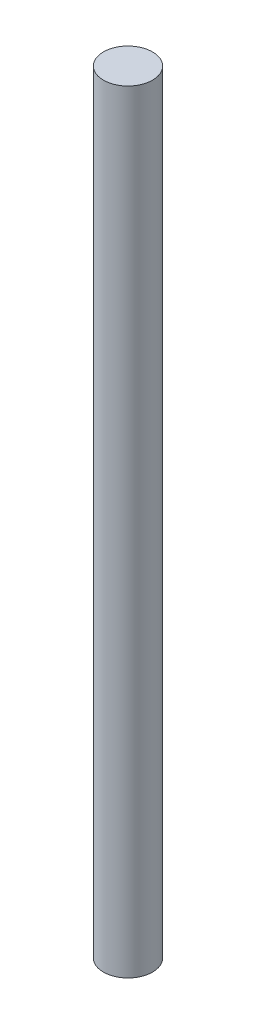
ISO-10303-21;
HEADER;
FILE_DESCRIPTION(('STEP AP214'),'2;1');
FILE_NAME('part.step','',(''),(''),'','','');
FILE_SCHEMA(('AUTOMOTIVE_DESIGN { 1 0 10303 214 1 1 1 1 }'));
ENDSEC;
DATA;
#1=APPLICATION_CONTEXT('core data for automotive mechanical design processes');
#2=APPLICATION_PROTOCOL_DEFINITION('international standard','automotive_design',2000,#1);
#3=PRODUCT_CONTEXT('',#1,'mechanical');
#4=PRODUCT('Part','Part','',(#3));
#5=PRODUCT_RELATED_PRODUCT_CATEGORY('part','',(#4));
#6=PRODUCT_DEFINITION_FORMATION('','',#4);
#7=PRODUCT_DEFINITION_CONTEXT('part definition',#1,'design');
#8=PRODUCT_DEFINITION('design','',#6,#7);
#9=PRODUCT_DEFINITION_SHAPE('','',#8);
#10=(LENGTH_UNIT() NAMED_UNIT(*) SI_UNIT(.MILLI.,.METRE.));
#11=(NAMED_UNIT(*) PLANE_ANGLE_UNIT() SI_UNIT($,.RADIAN.));
#12=(NAMED_UNIT(*) SI_UNIT($,.STERADIAN.) SOLID_ANGLE_UNIT());
#13=UNCERTAINTY_MEASURE_WITH_UNIT(LENGTH_MEASURE(1.E-05),#10,'distance_accuracy_value','');
#14=(GEOMETRIC_REPRESENTATION_CONTEXT(3) GLOBAL_UNCERTAINTY_ASSIGNED_CONTEXT((#13)) GLOBAL_UNIT_ASSIGNED_CONTEXT((#10,
#11,#12)) REPRESENTATION_CONTEXT('',''));
#15=CARTESIAN_POINT('',(0.,0.,0.));
#16=DIRECTION('',(0.,0.,1.));
#17=DIRECTION('',(1.,0.,0.));
#18=AXIS2_PLACEMENT_3D('',#15,#16,#17);
#19=CARTESIAN_POINT('',(0.,200.025,0.));
#20=DIRECTION('',(0.,-1.,0.));
#21=DIRECTION('',(0.,0.,-1.));
#22=AXIS2_PLACEMENT_3D('',#19,#20,#21);
#23=CYLINDRICAL_SURFACE('',#22,6.35);
#24=CARTESIAN_POINT('',(0.,200.025,0.));
#25=DIRECTION('',(0.,1.,0.));
#26=DIRECTION('',(0.,0.,1.));
#27=AXIS2_PLACEMENT_3D('',#24,#25,#26);
#28=CIRCLE('',#27,6.35);
#29=CARTESIAN_POINT('',(0.,200.025,6.35));
#30=VERTEX_POINT('',#29);
#31=EDGE_CURVE('E11',#30,#30,#28,.T.);
#32=ORIENTED_EDGE('',*,*,#31,.F.);
#33=EDGE_LOOP('',(#32));
#34=FACE_BOUND('',#33,.T.);
#35=CARTESIAN_POINT('',(0.,0.,0.));
#36=DIRECTION('',(0.,1.,0.));
#37=DIRECTION('',(0.,0.,1.));
#38=AXIS2_PLACEMENT_3D('',#35,#36,#37);
#39=CIRCLE('',#38,6.35);
#40=CARTESIAN_POINT('',(0.,0.,6.35));
#41=VERTEX_POINT('',#40);
#42=EDGE_CURVE('E35',#41,#41,#39,.T.);
#43=ORIENTED_EDGE('',*,*,#42,.T.);
#44=EDGE_LOOP('',(#43));
#45=FACE_BOUND('',#44,.T.);
#46=ADVANCED_FACE('F32',(#34,#45),#23,.T.);
#47=CARTESIAN_POINT('',(0.,200.025,0.));
#48=DIRECTION('',(0.,1.,0.));
#49=DIRECTION('',(0.,0.,1.));
#50=AXIS2_PLACEMENT_3D('',#47,#48,#49);
#51=PLANE('',#50);
#52=ORIENTED_EDGE('',*,*,#31,.T.);
#53=EDGE_LOOP('',(#52));
#54=FACE_BOUND('',#53,.T.);
#55=ADVANCED_FACE('F61',(#54),#51,.T.);
#56=CARTESIAN_POINT('',(0.,0.,0.));
#57=DIRECTION('',(0.,1.,0.));
#58=DIRECTION('',(0.,0.,1.));
#59=AXIS2_PLACEMENT_3D('',#56,#57,#58);
#60=PLANE('',#59);
#61=CARTESIAN_POINT('',(0.,0.,0.));
#62=DIRECTION('',(0.,-1.,0.));
#63=DIRECTION('',(0.,0.,-1.));
#64=AXIS2_PLACEMENT_3D('',#61,#62,#63);
#65=CIRCLE('',#64,1.47319999999999);
#66=CARTESIAN_POINT('',(0.,0.,-1.47319999999999));
#67=VERTEX_POINT('',#66);
#68=EDGE_CURVE('E51',#67,#67,#65,.T.);
#69=ORIENTED_EDGE('',*,*,#68,.F.);
#70=EDGE_LOOP('',(#69));
#71=FACE_BOUND('',#70,.T.);
#72=ORIENTED_EDGE('',*,*,#42,.F.);
#73=EDGE_LOOP('',(#72));
#74=FACE_BOUND('',#73,.T.);
#75=ADVANCED_FACE('F45',(#71,#74),#60,.F.);
#76=CARTESIAN_POINT('',(0.,3.6576,0.));
#77=DIRECTION('',(0.,-1.,0.));
#78=DIRECTION('',(0.,0.,-1.));
#79=AXIS2_PLACEMENT_3D('',#76,#77,#78);
#80=CONICAL_SURFACE('',#79,1.4732,1.02974425867665);
#81=CARTESIAN_POINT('',(0.,4.5427878639514,0.));
#82=VERTEX_POINT('',#81);
#83=VERTEX_LOOP('',#82);
#84=FACE_BOUND('',#83,.T.);
#85=CARTESIAN_POINT('',(0.,3.6576,0.));
#86=DIRECTION('',(0.,-1.,0.));
#87=DIRECTION('',(0.,0.,-1.));
#88=AXIS2_PLACEMENT_3D('',#85,#86,#87);
#89=CIRCLE('',#88,1.4732);
#90=CARTESIAN_POINT('',(0.,3.6576,-1.4732));
#91=VERTEX_POINT('',#90);
#92=EDGE_CURVE('E49',#91,#91,#89,.T.);
#93=ORIENTED_EDGE('',*,*,#92,.T.);
#94=EDGE_LOOP('',(#93));
#95=FACE_BOUND('',#94,.T.);
#96=ADVANCED_FACE('F41',(#84,#95),#80,.F.);
#97=CARTESIAN_POINT('',(0.,0.,0.));
#98=DIRECTION('',(0.,-1.,0.));
#99=DIRECTION('',(0.,0.,-1.));
#100=AXIS2_PLACEMENT_3D('',#97,#98,#99);
#101=CYLINDRICAL_SURFACE('',#100,1.47319999999999);
#102=ORIENTED_EDGE('',*,*,#92,.F.);
#103=EDGE_LOOP('',(#102));
#104=FACE_BOUND('',#103,.T.);
#105=ORIENTED_EDGE('',*,*,#68,.T.);
#106=EDGE_LOOP('',(#105));
#107=FACE_BOUND('',#106,.T.);
#108=ADVANCED_FACE('F44',(#104,#107),#101,.F.);
#109=CLOSED_SHELL('',(#46,#55,#75,#96,#108));
#110=MANIFOLD_SOLID_BREP('B2',#109);
#111=ADVANCED_BREP_SHAPE_REPRESENTATION('',(#18,#110),#14);
#112=SHAPE_DEFINITION_REPRESENTATION(#9,#111);
ENDSEC;
END-ISO-10303-21;
